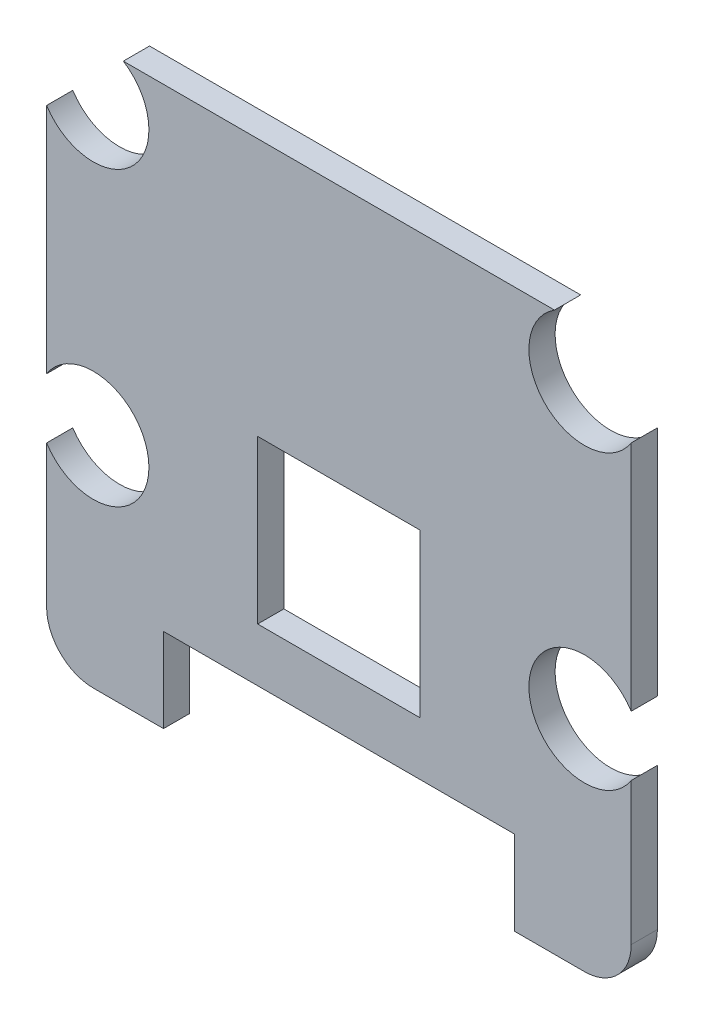
ISO-10303-21;
HEADER;
FILE_DESCRIPTION(('STEP AP214'),'2;1');
FILE_NAME('part.step','',(''),(''),'','','');
FILE_SCHEMA(('AUTOMOTIVE_DESIGN { 1 0 10303 214 1 1 1 1 }'));
ENDSEC;
DATA;
#1=APPLICATION_CONTEXT('core data for automotive mechanical design processes');
#2=APPLICATION_PROTOCOL_DEFINITION('international standard','automotive_design',2000,#1);
#3=PRODUCT_CONTEXT('',#1,'mechanical');
#4=PRODUCT('Part','Part','',(#3));
#5=PRODUCT_RELATED_PRODUCT_CATEGORY('part','',(#4));
#6=PRODUCT_DEFINITION_FORMATION('','',#4);
#7=PRODUCT_DEFINITION_CONTEXT('part definition',#1,'design');
#8=PRODUCT_DEFINITION('design','',#6,#7);
#9=PRODUCT_DEFINITION_SHAPE('','',#8);
#10=(LENGTH_UNIT() NAMED_UNIT(*) SI_UNIT(.MILLI.,.METRE.));
#11=(NAMED_UNIT(*) PLANE_ANGLE_UNIT() SI_UNIT($,.RADIAN.));
#12=(NAMED_UNIT(*) SI_UNIT($,.STERADIAN.) SOLID_ANGLE_UNIT());
#13=UNCERTAINTY_MEASURE_WITH_UNIT(LENGTH_MEASURE(1.E-05),#10,'distance_accuracy_value','');
#14=(GEOMETRIC_REPRESENTATION_CONTEXT(3) GLOBAL_UNCERTAINTY_ASSIGNED_CONTEXT((#13)) GLOBAL_UNIT_ASSIGNED_CONTEXT((#10,
#11,#12)) REPRESENTATION_CONTEXT('',''));
#15=CARTESIAN_POINT('',(0.,0.,0.));
#16=DIRECTION('',(0.,0.,1.));
#17=DIRECTION('',(1.,0.,0.));
#18=AXIS2_PLACEMENT_3D('',#15,#16,#17);
#19=CARTESIAN_POINT('',(-7.5,-9.362,-1.));
#20=DIRECTION('',(0.,-1.,0.));
#21=DIRECTION('',(-1.,0.,0.));
#22=AXIS2_PLACEMENT_3D('',#19,#20,#21);
#23=PLANE('',#22);
#24=DIRECTION('',(-1.,0.,0.));
#25=VECTOR('',#24,1.);
#26=CARTESIAN_POINT('',(10.4999970148151,-9.362,-1.));
#27=LINE('',#26,#25);
#28=CARTESIAN_POINT('',(-7.5,-9.362,-1.));
#29=VERTEX_POINT('',#28);
#30=CARTESIAN_POINT('',(-10.499997014778,-9.36199999999776,-1.));
#31=VERTEX_POINT('',#30);
#32=EDGE_CURVE('E20',#29,#31,#27,.T.);
#33=ORIENTED_EDGE('',*,*,#32,.T.);
#34=DIRECTION('',(0.,0.,-1.));
#35=VECTOR('',#34,1.);
#36=CARTESIAN_POINT('',(-10.499997014778,-9.36199999999776,-1.));
#37=LINE('',#36,#35);
#38=CARTESIAN_POINT('',(-10.499997014778,-9.36199999999776,-2.12));
#39=VERTEX_POINT('',#38);
#40=EDGE_CURVE('E381',#31,#39,#37,.T.);
#41=ORIENTED_EDGE('',*,*,#40,.T.);
#42=DIRECTION('',(-1.,0.,0.));
#43=VECTOR('',#42,1.);
#44=CARTESIAN_POINT('',(10.4999970148151,-9.362,-2.12));
#45=LINE('',#44,#43);
#46=CARTESIAN_POINT('',(-7.5,-9.362,-2.12));
#47=VERTEX_POINT('',#46);
#48=EDGE_CURVE('E286',#47,#39,#45,.T.);
#49=ORIENTED_EDGE('',*,*,#48,.F.);
#50=DIRECTION('',(0.,0.,-1.));
#51=VECTOR('',#50,1.);
#52=CARTESIAN_POINT('',(-7.5,-9.362,-1.));
#53=LINE('',#52,#51);
#54=EDGE_CURVE('E265',#29,#47,#53,.T.);
#55=ORIENTED_EDGE('',*,*,#54,.F.);
#56=EDGE_LOOP('',(#33,#41,#49,#55));
#57=FACE_BOUND('',#56,.T.);
#58=ADVANCED_FACE('F16',(#57),#23,.T.);
#59=CARTESIAN_POINT('',(-3.475,-3.475,-1.));
#60=DIRECTION('',(0.,1.,0.));
#61=DIRECTION('',(1.,0.,0.));
#62=AXIS2_PLACEMENT_3D('',#59,#60,#61);
#63=PLANE('',#62);
#64=DIRECTION('',(-1.,0.,0.));
#65=VECTOR('',#64,1.);
#66=CARTESIAN_POINT('',(3.475,-3.475,-1.));
#67=LINE('',#66,#65);
#68=CARTESIAN_POINT('',(3.475,-3.475,-1.));
#69=VERTEX_POINT('',#68);
#70=CARTESIAN_POINT('',(-3.475,-3.475,-1.));
#71=VERTEX_POINT('',#70);
#72=EDGE_CURVE('E236',#69,#71,#67,.T.);
#73=ORIENTED_EDGE('',*,*,#72,.F.);
#74=DIRECTION('',(0.,0.,-1.));
#75=VECTOR('',#74,1.);
#76=CARTESIAN_POINT('',(3.475,-3.475,-1.));
#77=LINE('',#76,#75);
#78=CARTESIAN_POINT('',(3.475,-3.475,-2.12));
#79=VERTEX_POINT('',#78);
#80=EDGE_CURVE('E11',#69,#79,#77,.T.);
#81=ORIENTED_EDGE('',*,*,#80,.T.);
#82=DIRECTION('',(1.,0.,0.));
#83=VECTOR('',#82,1.);
#84=CARTESIAN_POINT('',(3.475,-3.475,-2.12));
#85=LINE('',#84,#83);
#86=CARTESIAN_POINT('',(-3.475,-3.475,-2.12));
#87=VERTEX_POINT('',#86);
#88=EDGE_CURVE('E285',#87,#79,#85,.T.);
#89=ORIENTED_EDGE('',*,*,#88,.F.);
#90=DIRECTION('',(0.,0.,-1.));
#91=VECTOR('',#90,1.);
#92=CARTESIAN_POINT('',(-3.475,-3.475,-1.));
#93=LINE('',#92,#91);
#94=EDGE_CURVE('E239',#71,#87,#93,.T.);
#95=ORIENTED_EDGE('',*,*,#94,.F.);
#96=EDGE_LOOP('',(#73,#81,#89,#95));
#97=FACE_BOUND('',#96,.T.);
#98=ADVANCED_FACE('F508',(#97),#63,.T.);
#99=CARTESIAN_POINT('',(12.5,-1.28086884574495,-1.));
#100=DIRECTION('',(1.,0.,0.));
#101=DIRECTION('',(0.,1.,0.));
#102=AXIS2_PLACEMENT_3D('',#99,#100,#101);
#103=PLANE('',#102);
#104=DIRECTION('',(0.,-1.,0.));
#105=VECTOR('',#104,1.);
#106=CARTESIAN_POINT('',(12.5,15.780868845745,-1.));
#107=LINE('',#106,#105);
#108=CARTESIAN_POINT('',(12.5,-1.28086884574495,-1.));
#109=VERTEX_POINT('',#108);
#110=CARTESIAN_POINT('',(12.5000000000022,-7.362,-1.));
#111=VERTEX_POINT('',#110);
#112=EDGE_CURVE('E323',#109,#111,#107,.T.);
#113=ORIENTED_EDGE('',*,*,#112,.T.);
#114=DIRECTION('',(0.,0.,-1.));
#115=VECTOR('',#114,1.);
#116=CARTESIAN_POINT('',(12.5000000000022,-7.362,-1.));
#117=LINE('',#116,#115);
#118=CARTESIAN_POINT('',(12.5000000000022,-7.362,-2.12));
#119=VERTEX_POINT('',#118);
#120=EDGE_CURVE('E293',#111,#119,#117,.T.);
#121=ORIENTED_EDGE('',*,*,#120,.T.);
#122=DIRECTION('',(0.,-1.,0.));
#123=VECTOR('',#122,1.);
#124=CARTESIAN_POINT('',(12.5,15.780868845745,-2.12));
#125=LINE('',#124,#123);
#126=CARTESIAN_POINT('',(12.5,-1.28086884574495,-2.12));
#127=VERTEX_POINT('',#126);
#128=EDGE_CURVE('E341',#127,#119,#125,.T.);
#129=ORIENTED_EDGE('',*,*,#128,.F.);
#130=DIRECTION('',(0.,0.,-1.));
#131=VECTOR('',#130,1.);
#132=CARTESIAN_POINT('',(12.5,-1.28086884574495,-1.));
#133=LINE('',#132,#131);
#134=EDGE_CURVE('E135',#109,#127,#133,.T.);
#135=ORIENTED_EDGE('',*,*,#134,.F.);
#136=EDGE_LOOP('',(#113,#121,#129,#135));
#137=FACE_BOUND('',#136,.T.);
#138=ADVANCED_FACE('F471',(#137),#103,.T.);
#139=CARTESIAN_POINT('',(3.475,3.475,-1.));
#140=DIRECTION('',(0.,-1.,0.));
#141=DIRECTION('',(0.,0.,-1.));
#142=AXIS2_PLACEMENT_3D('',#139,#140,#141);
#143=PLANE('',#142);
#144=DIRECTION('',(1.,0.,0.));
#145=VECTOR('',#144,1.);
#146=CARTESIAN_POINT('',(-3.475,3.475,-1.));
#147=LINE('',#146,#145);
#148=CARTESIAN_POINT('',(-3.475,3.475,-1.));
#149=VERTEX_POINT('',#148);
#150=CARTESIAN_POINT('',(3.475,3.475,-1.));
#151=VERTEX_POINT('',#150);
#152=EDGE_CURVE('E214',#149,#151,#147,.T.);
#153=ORIENTED_EDGE('',*,*,#152,.F.);
#154=DIRECTION('',(0.,0.,-1.));
#155=VECTOR('',#154,1.);
#156=CARTESIAN_POINT('',(-3.475,3.475,-1.));
#157=LINE('',#156,#155);
#158=CARTESIAN_POINT('',(-3.475,3.475,-2.12));
#159=VERTEX_POINT('',#158);
#160=EDGE_CURVE('E217',#149,#159,#157,.T.);
#161=ORIENTED_EDGE('',*,*,#160,.T.);
#162=DIRECTION('',(-1.,0.,0.));
#163=VECTOR('',#162,1.);
#164=CARTESIAN_POINT('',(-3.475,3.475,-2.12));
#165=LINE('',#164,#163);
#166=CARTESIAN_POINT('',(3.475,3.475,-2.12));
#167=VERTEX_POINT('',#166);
#168=EDGE_CURVE('E85',#167,#159,#165,.T.);
#169=ORIENTED_EDGE('',*,*,#168,.F.);
#170=DIRECTION('',(0.,0.,-1.));
#171=VECTOR('',#170,1.);
#172=CARTESIAN_POINT('',(3.475,3.475,-1.));
#173=LINE('',#172,#171);
#174=EDGE_CURVE('E27',#151,#167,#173,.T.);
#175=ORIENTED_EDGE('',*,*,#174,.F.);
#176=EDGE_LOOP('',(#153,#161,#169,#175));
#177=FACE_BOUND('',#176,.T.);
#178=ADVANCED_FACE('F216',(#177),#143,.T.);
#179=CARTESIAN_POINT('',(3.475,-3.475,-1.));
#180=DIRECTION('',(-1.,0.,0.));
#181=DIRECTION('',(0.,0.,1.));
#182=AXIS2_PLACEMENT_3D('',#179,#180,#181);
#183=PLANE('',#182);
#184=DIRECTION('',(0.,-1.,0.));
#185=VECTOR('',#184,1.);
#186=CARTESIAN_POINT('',(3.475,3.475,-1.));
#187=LINE('',#186,#185);
#188=EDGE_CURVE('E223',#151,#69,#187,.T.);
#189=ORIENTED_EDGE('',*,*,#188,.F.);
#190=ORIENTED_EDGE('',*,*,#174,.T.);
#191=DIRECTION('',(0.,1.,0.));
#192=VECTOR('',#191,1.);
#193=CARTESIAN_POINT('',(3.475,3.475,-2.12));
#194=LINE('',#193,#192);
#195=EDGE_CURVE('E271',#79,#167,#194,.T.);
#196=ORIENTED_EDGE('',*,*,#195,.F.);
#197=ORIENTED_EDGE('',*,*,#80,.F.);
#198=EDGE_LOOP('',(#189,#190,#196,#197));
#199=FACE_BOUND('',#198,.T.);
#200=ADVANCED_FACE('F527',(#199),#183,.T.);
#201=CARTESIAN_POINT('',(1.11542719505309E-12,2.56899999999888,-1.));
#202=DIRECTION('',(0.,0.,1.));
#203=DIRECTION('',(1.,0.,0.));
#204=AXIS2_PLACEMENT_3D('',#201,#202,#203);
#205=PLANE('',#204);
#206=ORIENTED_EDGE('',*,*,#152,.T.);
#207=ORIENTED_EDGE('',*,*,#188,.T.);
#208=ORIENTED_EDGE('',*,*,#72,.T.);
#209=DIRECTION('',(0.,1.,0.));
#210=VECTOR('',#209,1.);
#211=CARTESIAN_POINT('',(-3.475,-3.475,-1.));
#212=LINE('',#211,#210);
#213=EDGE_CURVE('E229',#71,#149,#212,.T.);
#214=ORIENTED_EDGE('',*,*,#213,.T.);
#215=EDGE_LOOP('',(#206,#207,#208,#214));
#216=FACE_BOUND('',#215,.T.);
#217=CARTESIAN_POINT('',(10.5,-7.362,-1.));
#218=DIRECTION('',(0.,0.,1.));
#219=DIRECTION('',(-1.49259246295774E-06,-0.999999999998886,0.));
#220=AXIS2_PLACEMENT_3D('',#217,#218,#219);
#221=CIRCLE('',#220,2.00000000000223);
#222=CARTESIAN_POINT('',(10.4999970148151,-9.362,-1.));
#223=VERTEX_POINT('',#222);
#224=EDGE_CURVE('E289',#223,#111,#221,.T.);
#225=ORIENTED_EDGE('',*,*,#224,.T.);
#226=ORIENTED_EDGE('',*,*,#112,.F.);
#227=CARTESIAN_POINT('',(10.5,0.,-1.));
#228=DIRECTION('',(0.,0.,1.));
#229=DIRECTION('',(0.842105263157895,0.5393131982084,0.));
#230=AXIS2_PLACEMENT_3D('',#227,#228,#229);
#231=CIRCLE('',#230,2.375);
#232=CARTESIAN_POINT('',(12.5,1.28086884574495,-1.));
#233=VERTEX_POINT('',#232);
#234=EDGE_CURVE('E324',#233,#109,#231,.T.);
#235=ORIENTED_EDGE('',*,*,#234,.F.);
#236=DIRECTION('',(0.,-1.,0.));
#237=VECTOR('',#236,1.);
#238=CARTESIAN_POINT('',(12.5,15.780868845745,-1.));
#239=LINE('',#238,#237);
#240=CARTESIAN_POINT('',(12.5000000000002,11.2191311542554,-1.));
#241=VERTEX_POINT('',#240);
#242=EDGE_CURVE('E313',#241,#233,#239,.T.);
#243=ORIENTED_EDGE('',*,*,#242,.F.);
#244=CARTESIAN_POINT('',(10.5,12.5,-1.));
#245=DIRECTION('',(0.,0.,1.));
#246=DIRECTION('',(-0.539313198208399,0.842105263157895,0.));
#247=AXIS2_PLACEMENT_3D('',#244,#245,#246);
#248=CIRCLE('',#247,2.375);
#249=CARTESIAN_POINT('',(9.21913115425505,14.5,-1.));
#250=VERTEX_POINT('',#249);
#251=EDGE_CURVE('E354',#250,#241,#248,.T.);
#252=ORIENTED_EDGE('',*,*,#251,.F.);
#253=DIRECTION('',(1.,0.,0.));
#254=VECTOR('',#253,1.);
#255=CARTESIAN_POINT('',(-10.5,14.5,-1.));
#256=LINE('',#255,#254);
#257=CARTESIAN_POINT('',(-9.21913115425505,14.5,-1.));
#258=VERTEX_POINT('',#257);
#259=EDGE_CURVE('E394',#258,#250,#256,.T.);
#260=ORIENTED_EDGE('',*,*,#259,.F.);
#261=CARTESIAN_POINT('',(-10.5,12.5,-1.));
#262=DIRECTION('',(0.,0.,1.));
#263=DIRECTION('',(-0.842105263157894,-0.539313198208401,0.));
#264=AXIS2_PLACEMENT_3D('',#261,#262,#263);
#265=CIRCLE('',#264,2.375);
#266=CARTESIAN_POINT('',(-12.5,11.219131154255,-1.));
#267=VERTEX_POINT('',#266);
#268=EDGE_CURVE('E361',#267,#258,#265,.T.);
#269=ORIENTED_EDGE('',*,*,#268,.F.);
#270=DIRECTION('',(0.,1.,0.));
#271=VECTOR('',#270,1.);
#272=CARTESIAN_POINT('',(-12.5,-7.362,-1.));
#273=LINE('',#272,#271);
#274=CARTESIAN_POINT('',(-12.5,1.28086884574495,-1.));
#275=VERTEX_POINT('',#274);
#276=EDGE_CURVE('E232',#275,#267,#273,.T.);
#277=ORIENTED_EDGE('',*,*,#276,.F.);
#278=CARTESIAN_POINT('',(-10.5,0.,-1.));
#279=DIRECTION('',(0.,0.,1.));
#280=DIRECTION('',(-0.842105263157893,-0.539313198208402,0.));
#281=AXIS2_PLACEMENT_3D('',#278,#279,#280);
#282=CIRCLE('',#281,2.375);
#283=CARTESIAN_POINT('',(-12.5,-1.28086884574496,-1.));
#284=VERTEX_POINT('',#283);
#285=EDGE_CURVE('E69',#284,#275,#282,.T.);
#286=ORIENTED_EDGE('',*,*,#285,.F.);
#287=DIRECTION('',(0.,1.,0.));
#288=VECTOR('',#287,1.);
#289=CARTESIAN_POINT('',(-12.5,-7.362,-1.));
#290=LINE('',#289,#288);
#291=CARTESIAN_POINT('',(-12.5,-7.362,-1.));
#292=VERTEX_POINT('',#291);
#293=EDGE_CURVE('E267',#292,#284,#290,.T.);
#294=ORIENTED_EDGE('',*,*,#293,.F.);
#295=CARTESIAN_POINT('',(-10.5,-7.362,-1.));
#296=DIRECTION('',(0.,0.,1.));
#297=DIRECTION('',(-1.,0.,0.));
#298=AXIS2_PLACEMENT_3D('',#295,#296,#297);
#299=CIRCLE('',#298,2.);
#300=EDGE_CURVE('E276',#292,#31,#299,.T.);
#301=ORIENTED_EDGE('',*,*,#300,.T.);
#302=ORIENTED_EDGE('',*,*,#32,.F.);
#303=DIRECTION('',(0.,-1.,0.));
#304=VECTOR('',#303,1.);
#305=CARTESIAN_POINT('',(-7.5,-5.762,-1.));
#306=LINE('',#305,#304);
#307=CARTESIAN_POINT('',(-7.5,-5.762,-1.));
#308=VERTEX_POINT('',#307);
#309=EDGE_CURVE('E275',#308,#29,#306,.T.);
#310=ORIENTED_EDGE('',*,*,#309,.F.);
#311=DIRECTION('',(-1.,0.,0.));
#312=VECTOR('',#311,1.);
#313=CARTESIAN_POINT('',(7.5,-5.762,-1.));
#314=LINE('',#313,#312);
#315=CARTESIAN_POINT('',(7.5,-5.762,-1.));
#316=VERTEX_POINT('',#315);
#317=EDGE_CURVE('E294',#316,#308,#314,.T.);
#318=ORIENTED_EDGE('',*,*,#317,.F.);
#319=DIRECTION('',(0.,1.,0.));
#320=VECTOR('',#319,1.);
#321=CARTESIAN_POINT('',(7.5,-9.362,-1.));
#322=LINE('',#321,#320);
#323=CARTESIAN_POINT('',(7.5,-9.362,-1.));
#324=VERTEX_POINT('',#323);
#325=EDGE_CURVE('E325',#324,#316,#322,.T.);
#326=ORIENTED_EDGE('',*,*,#325,.F.);
#327=DIRECTION('',(-1.,0.,0.));
#328=VECTOR('',#327,1.);
#329=CARTESIAN_POINT('',(10.4999970148151,-9.362,-1.));
#330=LINE('',#329,#328);
#331=EDGE_CURVE('E270',#223,#324,#330,.T.);
#332=ORIENTED_EDGE('',*,*,#331,.F.);
#333=EDGE_LOOP('',(#225,#226,#235,#243,#252,#260,#269,#277,#286,#294,#301,#302,#310,#318,#326,#332));
#334=FACE_BOUND('',#333,.T.);
#335=ADVANCED_FACE('F234',(#216,#334),#205,.T.);
#336=CARTESIAN_POINT('',(10.5,0.,-1.));
#337=DIRECTION('',(0.,0.,-1.));
#338=DIRECTION('',(-1.,0.,0.));
#339=AXIS2_PLACEMENT_3D('',#336,#337,#338);
#340=CYLINDRICAL_SURFACE('',#339,2.375);
#341=ORIENTED_EDGE('',*,*,#234,.T.);
#342=ORIENTED_EDGE('',*,*,#134,.T.);
#343=CARTESIAN_POINT('',(10.5,0.,-2.12));
#344=DIRECTION('',(0.,0.,1.));
#345=DIRECTION('',(0.842105263157895,0.5393131982084,0.));
#346=AXIS2_PLACEMENT_3D('',#343,#344,#345);
#347=CIRCLE('',#346,2.375);
#348=CARTESIAN_POINT('',(12.5,1.28086884574495,-2.12));
#349=VERTEX_POINT('',#348);
#350=EDGE_CURVE('E345',#349,#127,#347,.T.);
#351=ORIENTED_EDGE('',*,*,#350,.F.);
#352=DIRECTION('',(0.,0.,-1.));
#353=VECTOR('',#352,1.);
#354=CARTESIAN_POINT('',(12.5,1.28086884574495,-1.));
#355=LINE('',#354,#353);
#356=EDGE_CURVE('E349',#233,#349,#355,.T.);
#357=ORIENTED_EDGE('',*,*,#356,.F.);
#358=EDGE_LOOP('',(#341,#342,#351,#357));
#359=FACE_BOUND('',#358,.T.);
#360=ADVANCED_FACE('F18',(#359),#340,.F.);
#361=CARTESIAN_POINT('',(10.5,-7.362,-1.));
#362=DIRECTION('',(0.,0.,-1.));
#363=DIRECTION('',(-1.49259246295774E-06,-0.999999999998886,0.));
#364=AXIS2_PLACEMENT_3D('',#361,#362,#363);
#365=CYLINDRICAL_SURFACE('',#364,2.00000000000223);
#366=ORIENTED_EDGE('',*,*,#224,.F.);
#367=DIRECTION('',(0.,0.,-1.));
#368=VECTOR('',#367,1.);
#369=CARTESIAN_POINT('',(10.4999970148151,-9.362,-1.));
#370=LINE('',#369,#368);
#371=CARTESIAN_POINT('',(10.4999970148151,-9.362,-2.12));
#372=VERTEX_POINT('',#371);
#373=EDGE_CURVE('E317',#223,#372,#370,.T.);
#374=ORIENTED_EDGE('',*,*,#373,.T.);
#375=CARTESIAN_POINT('',(10.5,-7.362,-2.12));
#376=DIRECTION('',(0.,0.,-1.));
#377=DIRECTION('',(-1.49259246295774E-06,-0.999999999998886,0.));
#378=AXIS2_PLACEMENT_3D('',#375,#376,#377);
#379=CIRCLE('',#378,2.00000000000223);
#380=EDGE_CURVE('E260',#119,#372,#379,.T.);
#381=ORIENTED_EDGE('',*,*,#380,.F.);
#382=ORIENTED_EDGE('',*,*,#120,.F.);
#383=EDGE_LOOP('',(#366,#374,#381,#382));
#384=FACE_BOUND('',#383,.T.);
#385=ADVANCED_FACE('F473',(#384),#365,.T.);
#386=CARTESIAN_POINT('',(7.5,-5.762,-1.));
#387=DIRECTION('',(0.,-1.,0.));
#388=DIRECTION('',(0.,0.,-1.));
#389=AXIS2_PLACEMENT_3D('',#386,#387,#388);
#390=PLANE('',#389);
#391=ORIENTED_EDGE('',*,*,#317,.T.);
#392=DIRECTION('',(0.,0.,-1.));
#393=VECTOR('',#392,1.);
#394=CARTESIAN_POINT('',(-7.5,-5.762,-1.));
#395=LINE('',#394,#393);
#396=CARTESIAN_POINT('',(-7.5,-5.762,-2.12));
#397=VERTEX_POINT('',#396);
#398=EDGE_CURVE('E264',#308,#397,#395,.T.);
#399=ORIENTED_EDGE('',*,*,#398,.T.);
#400=DIRECTION('',(-1.,0.,0.));
#401=VECTOR('',#400,1.);
#402=CARTESIAN_POINT('',(7.5,-5.762,-2.12));
#403=LINE('',#402,#401);
#404=CARTESIAN_POINT('',(7.5,-5.762,-2.12));
#405=VERTEX_POINT('',#404);
#406=EDGE_CURVE('E259',#405,#397,#403,.T.);
#407=ORIENTED_EDGE('',*,*,#406,.F.);
#408=DIRECTION('',(0.,0.,-1.));
#409=VECTOR('',#408,1.);
#410=CARTESIAN_POINT('',(7.5,-5.762,-1.));
#411=LINE('',#410,#409);
#412=EDGE_CURVE('E329',#316,#405,#411,.T.);
#413=ORIENTED_EDGE('',*,*,#412,.F.);
#414=EDGE_LOOP('',(#391,#399,#407,#413));
#415=FACE_BOUND('',#414,.T.);
#416=ADVANCED_FACE('F485',(#415),#390,.T.);
#417=CARTESIAN_POINT('',(10.4999970148151,-9.362,-1.));
#418=DIRECTION('',(0.,-1.,0.));
#419=DIRECTION('',(-1.,0.,0.));
#420=AXIS2_PLACEMENT_3D('',#417,#418,#419);
#421=PLANE('',#420);
#422=ORIENTED_EDGE('',*,*,#331,.T.);
#423=DIRECTION('',(0.,0.,-1.));
#424=VECTOR('',#423,1.);
#425=CARTESIAN_POINT('',(7.5,-9.362,-1.));
#426=LINE('',#425,#424);
#427=CARTESIAN_POINT('',(7.5,-9.362,-2.12));
#428=VERTEX_POINT('',#427);
#429=EDGE_CURVE('E308',#324,#428,#426,.T.);
#430=ORIENTED_EDGE('',*,*,#429,.T.);
#431=DIRECTION('',(-1.,0.,0.));
#432=VECTOR('',#431,1.);
#433=CARTESIAN_POINT('',(10.4999970148151,-9.362,-2.12));
#434=LINE('',#433,#432);
#435=EDGE_CURVE('E255',#372,#428,#434,.T.);
#436=ORIENTED_EDGE('',*,*,#435,.F.);
#437=ORIENTED_EDGE('',*,*,#373,.F.);
#438=EDGE_LOOP('',(#422,#430,#436,#437));
#439=FACE_BOUND('',#438,.T.);
#440=ADVANCED_FACE('F479',(#439),#421,.T.);
#441=CARTESIAN_POINT('',(-12.5,-7.362,-1.));
#442=DIRECTION('',(-1.,0.,0.));
#443=DIRECTION('',(0.,0.,1.));
#444=AXIS2_PLACEMENT_3D('',#441,#442,#443);
#445=PLANE('',#444);
#446=ORIENTED_EDGE('',*,*,#293,.T.);
#447=DIRECTION('',(0.,0.,-1.));
#448=VECTOR('',#447,1.);
#449=CARTESIAN_POINT('',(-12.5,-1.28086884574496,-1.));
#450=LINE('',#449,#448);
#451=CARTESIAN_POINT('',(-12.5,-1.28086884574496,-2.12));
#452=VERTEX_POINT('',#451);
#453=EDGE_CURVE('E304',#284,#452,#450,.T.);
#454=ORIENTED_EDGE('',*,*,#453,.T.);
#455=DIRECTION('',(0.,1.,0.));
#456=VECTOR('',#455,1.);
#457=CARTESIAN_POINT('',(-12.5,-7.362,-2.12));
#458=LINE('',#457,#456);
#459=CARTESIAN_POINT('',(-12.5,-7.362,-2.12));
#460=VERTEX_POINT('',#459);
#461=EDGE_CURVE('E194',#460,#452,#458,.T.);
#462=ORIENTED_EDGE('',*,*,#461,.F.);
#463=DIRECTION('',(0.,0.,-1.));
#464=VECTOR('',#463,1.);
#465=CARTESIAN_POINT('',(-12.5,-7.362,-1.));
#466=LINE('',#465,#464);
#467=EDGE_CURVE('E280',#292,#460,#466,.T.);
#468=ORIENTED_EDGE('',*,*,#467,.F.);
#469=EDGE_LOOP('',(#446,#454,#462,#468));
#470=FACE_BOUND('',#469,.T.);
#471=ADVANCED_FACE('F430',(#470),#445,.T.);
#472=CARTESIAN_POINT('',(1.11542719505309E-12,2.56899999999888,-2.12));
#473=DIRECTION('',(0.,0.,1.));
#474=DIRECTION('',(1.,0.,0.));
#475=AXIS2_PLACEMENT_3D('',#472,#473,#474);
#476=PLANE('',#475);
#477=ORIENTED_EDGE('',*,*,#168,.T.);
#478=DIRECTION('',(0.,-1.,0.));
#479=VECTOR('',#478,1.);
#480=CARTESIAN_POINT('',(-3.475,-3.475,-2.12));
#481=LINE('',#480,#479);
#482=EDGE_CURVE('E230',#159,#87,#481,.T.);
#483=ORIENTED_EDGE('',*,*,#482,.T.);
#484=ORIENTED_EDGE('',*,*,#88,.T.);
#485=ORIENTED_EDGE('',*,*,#195,.T.);
#486=EDGE_LOOP('',(#477,#483,#484,#485));
#487=FACE_BOUND('',#486,.T.);
#488=ORIENTED_EDGE('',*,*,#380,.T.);
#489=ORIENTED_EDGE('',*,*,#435,.T.);
#490=DIRECTION('',(0.,1.,0.));
#491=VECTOR('',#490,1.);
#492=CARTESIAN_POINT('',(7.5,-9.362,-2.12));
#493=LINE('',#492,#491);
#494=EDGE_CURVE('E336',#428,#405,#493,.T.);
#495=ORIENTED_EDGE('',*,*,#494,.T.);
#496=ORIENTED_EDGE('',*,*,#406,.T.);
#497=DIRECTION('',(0.,-1.,0.));
#498=VECTOR('',#497,1.);
#499=CARTESIAN_POINT('',(-7.5,-5.762,-2.12));
#500=LINE('',#499,#498);
#501=EDGE_CURVE('E261',#397,#47,#500,.T.);
#502=ORIENTED_EDGE('',*,*,#501,.T.);
#503=ORIENTED_EDGE('',*,*,#48,.T.);
#504=CARTESIAN_POINT('',(-10.5,-7.362,-2.12));
#505=DIRECTION('',(0.,0.,-1.));
#506=DIRECTION('',(-1.,0.,0.));
#507=AXIS2_PLACEMENT_3D('',#504,#505,#506);
#508=CIRCLE('',#507,2.);
#509=EDGE_CURVE('E378',#39,#460,#508,.T.);
#510=ORIENTED_EDGE('',*,*,#509,.T.);
#511=ORIENTED_EDGE('',*,*,#461,.T.);
#512=CARTESIAN_POINT('',(-10.5,0.,-2.12));
#513=DIRECTION('',(0.,0.,1.));
#514=DIRECTION('',(-0.842105263157893,-0.539313198208402,0.));
#515=AXIS2_PLACEMENT_3D('',#512,#513,#514);
#516=CIRCLE('',#515,2.375);
#517=CARTESIAN_POINT('',(-12.5,1.28086884574495,-2.12));
#518=VERTEX_POINT('',#517);
#519=EDGE_CURVE('E301',#452,#518,#516,.T.);
#520=ORIENTED_EDGE('',*,*,#519,.T.);
#521=DIRECTION('',(0.,1.,0.));
#522=VECTOR('',#521,1.);
#523=CARTESIAN_POINT('',(-12.5,-7.362,-2.12));
#524=LINE('',#523,#522);
#525=CARTESIAN_POINT('',(-12.5,11.219131154255,-2.12));
#526=VERTEX_POINT('',#525);
#527=EDGE_CURVE('E295',#518,#526,#524,.T.);
#528=ORIENTED_EDGE('',*,*,#527,.T.);
#529=CARTESIAN_POINT('',(-10.5,12.5,-2.12));
#530=DIRECTION('',(0.,0.,1.));
#531=DIRECTION('',(-0.842105263157894,-0.539313198208401,0.));
#532=AXIS2_PLACEMENT_3D('',#529,#530,#531);
#533=CIRCLE('',#532,2.375);
#534=CARTESIAN_POINT('',(-9.21913115425505,14.5,-2.12));
#535=VERTEX_POINT('',#534);
#536=EDGE_CURVE('E340',#526,#535,#533,.T.);
#537=ORIENTED_EDGE('',*,*,#536,.T.);
#538=DIRECTION('',(1.,0.,0.));
#539=VECTOR('',#538,1.);
#540=CARTESIAN_POINT('',(-10.5,14.5,-2.12));
#541=LINE('',#540,#539);
#542=CARTESIAN_POINT('',(9.21913115425505,14.5,-2.12));
#543=VERTEX_POINT('',#542);
#544=EDGE_CURVE('E314',#535,#543,#541,.T.);
#545=ORIENTED_EDGE('',*,*,#544,.T.);
#546=CARTESIAN_POINT('',(10.5,12.5,-2.12));
#547=DIRECTION('',(0.,0.,1.));
#548=DIRECTION('',(-0.539313198208399,0.842105263157895,0.));
#549=AXIS2_PLACEMENT_3D('',#546,#547,#548);
#550=CIRCLE('',#549,2.375);
#551=CARTESIAN_POINT('',(12.5000000000002,11.2191311542554,-2.12));
#552=VERTEX_POINT('',#551);
#553=EDGE_CURVE('E330',#543,#552,#550,.T.);
#554=ORIENTED_EDGE('',*,*,#553,.T.);
#555=DIRECTION('',(0.,-1.,0.));
#556=VECTOR('',#555,1.);
#557=CARTESIAN_POINT('',(12.5,15.780868845745,-2.12));
#558=LINE('',#557,#556);
#559=EDGE_CURVE('E250',#552,#349,#558,.T.);
#560=ORIENTED_EDGE('',*,*,#559,.T.);
#561=ORIENTED_EDGE('',*,*,#350,.T.);
#562=ORIENTED_EDGE('',*,*,#128,.T.);
#563=EDGE_LOOP('',(#488,#489,#495,#496,#502,#503,#510,#511,#520,#528,#537,#545,#554,#560,#561,#562));
#564=FACE_BOUND('',#563,.T.);
#565=ADVANCED_FACE('F436',(#487,#564),#476,.F.);
#566=CARTESIAN_POINT('',(7.5,-9.362,-1.));
#567=DIRECTION('',(-1.,0.,0.));
#568=DIRECTION('',(0.,0.,1.));
#569=AXIS2_PLACEMENT_3D('',#566,#567,#568);
#570=PLANE('',#569);
#571=ORIENTED_EDGE('',*,*,#325,.T.);
#572=ORIENTED_EDGE('',*,*,#412,.T.);
#573=ORIENTED_EDGE('',*,*,#494,.F.);
#574=ORIENTED_EDGE('',*,*,#429,.F.);
#575=EDGE_LOOP('',(#571,#572,#573,#574));
#576=FACE_BOUND('',#575,.T.);
#577=ADVANCED_FACE('F482',(#576),#570,.T.);
#578=CARTESIAN_POINT('',(10.5,12.5,-1.));
#579=DIRECTION('',(0.,0.,-1.));
#580=DIRECTION('',(-0.707106781186485,-0.70710678118661,0.));
#581=AXIS2_PLACEMENT_3D('',#578,#579,#580);
#582=CYLINDRICAL_SURFACE('',#581,2.375);
#583=ORIENTED_EDGE('',*,*,#251,.T.);
#584=DIRECTION('',(0.,0.,-1.));
#585=VECTOR('',#584,1.);
#586=CARTESIAN_POINT('',(12.5000000000002,11.2191311542554,-1.));
#587=LINE('',#586,#585);
#588=EDGE_CURVE('E240',#241,#552,#587,.T.);
#589=ORIENTED_EDGE('',*,*,#588,.T.);
#590=ORIENTED_EDGE('',*,*,#553,.F.);
#591=DIRECTION('',(0.,0.,-1.));
#592=VECTOR('',#591,1.);
#593=CARTESIAN_POINT('',(9.21913115425505,14.5,-1.));
#594=LINE('',#593,#592);
#595=EDGE_CURVE('E390',#250,#543,#594,.T.);
#596=ORIENTED_EDGE('',*,*,#595,.F.);
#597=EDGE_LOOP('',(#583,#589,#590,#596));
#598=FACE_BOUND('',#597,.T.);
#599=ADVANCED_FACE('F457',(#598),#582,.F.);
#600=CARTESIAN_POINT('',(-10.5,-7.362,-1.));
#601=DIRECTION('',(0.,0.,-1.));
#602=DIRECTION('',(-1.,0.,0.));
#603=AXIS2_PLACEMENT_3D('',#600,#601,#602);
#604=CYLINDRICAL_SURFACE('',#603,2.);
#605=ORIENTED_EDGE('',*,*,#300,.F.);
#606=ORIENTED_EDGE('',*,*,#467,.T.);
#607=ORIENTED_EDGE('',*,*,#509,.F.);
#608=ORIENTED_EDGE('',*,*,#40,.F.);
#609=EDGE_LOOP('',(#605,#606,#607,#608));
#610=FACE_BOUND('',#609,.T.);
#611=ADVANCED_FACE('F441',(#610),#604,.T.);
#612=CARTESIAN_POINT('',(-7.5,-5.762,-1.));
#613=DIRECTION('',(1.,0.,0.));
#614=DIRECTION('',(0.,1.,0.));
#615=AXIS2_PLACEMENT_3D('',#612,#613,#614);
#616=PLANE('',#615);
#617=ORIENTED_EDGE('',*,*,#309,.T.);
#618=ORIENTED_EDGE('',*,*,#54,.T.);
#619=ORIENTED_EDGE('',*,*,#501,.F.);
#620=ORIENTED_EDGE('',*,*,#398,.F.);
#621=EDGE_LOOP('',(#617,#618,#619,#620));
#622=FACE_BOUND('',#621,.T.);
#623=ADVANCED_FACE('F495',(#622),#616,.T.);
#624=CARTESIAN_POINT('',(-10.5,12.5,-1.));
#625=DIRECTION('',(0.,0.,-1.));
#626=DIRECTION('',(0.707106781186549,-0.707106781186547,0.));
#627=AXIS2_PLACEMENT_3D('',#624,#625,#626);
#628=CYLINDRICAL_SURFACE('',#627,2.375);
#629=ORIENTED_EDGE('',*,*,#268,.T.);
#630=DIRECTION('',(0.,0.,-1.));
#631=VECTOR('',#630,1.);
#632=CARTESIAN_POINT('',(-9.21913115425505,14.5,-1.));
#633=LINE('',#632,#631);
#634=EDGE_CURVE('E309',#258,#535,#633,.T.);
#635=ORIENTED_EDGE('',*,*,#634,.T.);
#636=ORIENTED_EDGE('',*,*,#536,.F.);
#637=DIRECTION('',(0.,0.,-1.));
#638=VECTOR('',#637,1.);
#639=CARTESIAN_POINT('',(-12.5,11.219131154255,-1.));
#640=LINE('',#639,#638);
#641=EDGE_CURVE('E300',#267,#526,#640,.T.);
#642=ORIENTED_EDGE('',*,*,#641,.F.);
#643=EDGE_LOOP('',(#629,#635,#636,#642));
#644=FACE_BOUND('',#643,.T.);
#645=ADVANCED_FACE('F449',(#644),#628,.F.);
#646=CARTESIAN_POINT('',(-10.5,0.,-1.));
#647=DIRECTION('',(0.,0.,-1.));
#648=DIRECTION('',(1.,0.,0.));
#649=AXIS2_PLACEMENT_3D('',#646,#647,#648);
#650=CYLINDRICAL_SURFACE('',#649,2.375);
#651=ORIENTED_EDGE('',*,*,#285,.T.);
#652=DIRECTION('',(0.,0.,-1.));
#653=VECTOR('',#652,1.);
#654=CARTESIAN_POINT('',(-12.5,1.28086884574495,-1.));
#655=LINE('',#654,#653);
#656=EDGE_CURVE('E299',#275,#518,#655,.T.);
#657=ORIENTED_EDGE('',*,*,#656,.T.);
#658=ORIENTED_EDGE('',*,*,#519,.F.);
#659=ORIENTED_EDGE('',*,*,#453,.F.);
#660=EDGE_LOOP('',(#651,#657,#658,#659));
#661=FACE_BOUND('',#660,.T.);
#662=ADVANCED_FACE('F433',(#661),#650,.F.);
#663=CARTESIAN_POINT('',(-12.5,1.28086884574495,-1.));
#664=DIRECTION('',(-1.,0.,0.));
#665=DIRECTION('',(0.,0.,1.));
#666=AXIS2_PLACEMENT_3D('',#663,#664,#665);
#667=PLANE('',#666);
#668=ORIENTED_EDGE('',*,*,#276,.T.);
#669=ORIENTED_EDGE('',*,*,#641,.T.);
#670=ORIENTED_EDGE('',*,*,#527,.F.);
#671=ORIENTED_EDGE('',*,*,#656,.F.);
#672=EDGE_LOOP('',(#668,#669,#670,#671));
#673=FACE_BOUND('',#672,.T.);
#674=ADVANCED_FACE('F447',(#673),#667,.T.);
#675=CARTESIAN_POINT('',(-3.475,3.475,-1.));
#676=DIRECTION('',(1.,0.,0.));
#677=DIRECTION('',(0.,1.,0.));
#678=AXIS2_PLACEMENT_3D('',#675,#676,#677);
#679=PLANE('',#678);
#680=ORIENTED_EDGE('',*,*,#213,.F.);
#681=ORIENTED_EDGE('',*,*,#94,.T.);
#682=ORIENTED_EDGE('',*,*,#482,.F.);
#683=ORIENTED_EDGE('',*,*,#160,.F.);
#684=EDGE_LOOP('',(#680,#681,#682,#683));
#685=FACE_BOUND('',#684,.T.);
#686=ADVANCED_FACE('F227',(#685),#679,.T.);
#687=CARTESIAN_POINT('',(12.5,11.2191311542554,-1.));
#688=DIRECTION('',(1.,0.,0.));
#689=DIRECTION('',(0.,1.,0.));
#690=AXIS2_PLACEMENT_3D('',#687,#688,#689);
#691=PLANE('',#690);
#692=ORIENTED_EDGE('',*,*,#242,.T.);
#693=ORIENTED_EDGE('',*,*,#356,.T.);
#694=ORIENTED_EDGE('',*,*,#559,.F.);
#695=ORIENTED_EDGE('',*,*,#588,.F.);
#696=EDGE_LOOP('',(#692,#693,#694,#695));
#697=FACE_BOUND('',#696,.T.);
#698=ADVANCED_FACE('F462',(#697),#691,.T.);
#699=CARTESIAN_POINT('',(-9.21913115425505,14.5,-1.));
#700=DIRECTION('',(0.,1.,0.));
#701=DIRECTION('',(1.,0.,0.));
#702=AXIS2_PLACEMENT_3D('',#699,#700,#701);
#703=PLANE('',#702);
#704=ORIENTED_EDGE('',*,*,#259,.T.);
#705=ORIENTED_EDGE('',*,*,#595,.T.);
#706=ORIENTED_EDGE('',*,*,#544,.F.);
#707=ORIENTED_EDGE('',*,*,#634,.F.);
#708=EDGE_LOOP('',(#704,#705,#706,#707));
#709=FACE_BOUND('',#708,.T.);
#710=ADVANCED_FACE('F455',(#709),#703,.T.);
#711=CLOSED_SHELL('',(#58,#98,#138,#178,#200,#335,#360,#385,#416,#440,#471,#565,#577,#599,#611,
#623,#645,#662,#674,#686,#698,#710));
#712=MANIFOLD_SOLID_BREP('B1',#711);
#713=ADVANCED_BREP_SHAPE_REPRESENTATION('',(#18,#712),#14);
#714=SHAPE_DEFINITION_REPRESENTATION(#9,#713);
ENDSEC;
END-ISO-10303-21;
